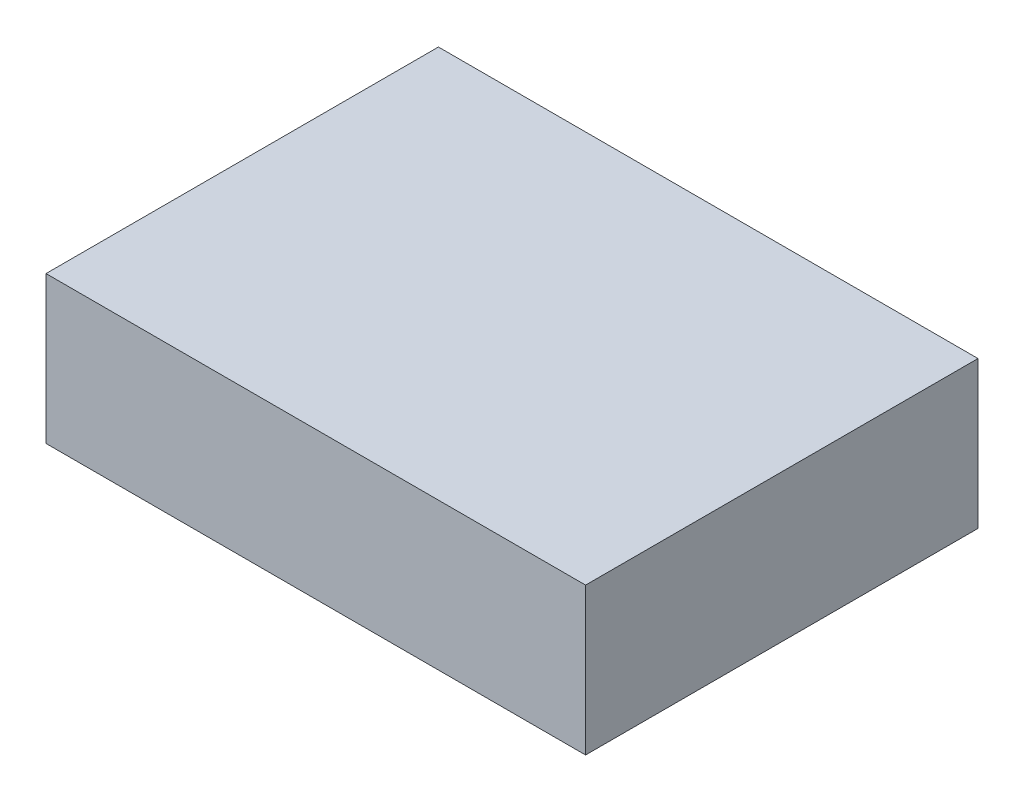
ISO-10303-21;
HEADER;
FILE_DESCRIPTION(('STEP AP214'),'2;1');
FILE_NAME('part.step','',(''),(''),'','','');
FILE_SCHEMA(('AUTOMOTIVE_DESIGN { 1 0 10303 214 1 1 1 1 }'));
ENDSEC;
DATA;
#1=APPLICATION_CONTEXT('core data for automotive mechanical design processes');
#2=APPLICATION_PROTOCOL_DEFINITION('international standard','automotive_design',2000,#1);
#3=PRODUCT_CONTEXT('',#1,'mechanical');
#4=PRODUCT('Part','Part','',(#3));
#5=PRODUCT_RELATED_PRODUCT_CATEGORY('part','',(#4));
#6=PRODUCT_DEFINITION_FORMATION('','',#4);
#7=PRODUCT_DEFINITION_CONTEXT('part definition',#1,'design');
#8=PRODUCT_DEFINITION('design','',#6,#7);
#9=PRODUCT_DEFINITION_SHAPE('','',#8);
#10=(LENGTH_UNIT() NAMED_UNIT(*) SI_UNIT(.MILLI.,.METRE.));
#11=(NAMED_UNIT(*) PLANE_ANGLE_UNIT() SI_UNIT($,.RADIAN.));
#12=(NAMED_UNIT(*) SI_UNIT($,.STERADIAN.) SOLID_ANGLE_UNIT());
#13=UNCERTAINTY_MEASURE_WITH_UNIT(LENGTH_MEASURE(1.E-05),#10,'distance_accuracy_value','');
#14=(GEOMETRIC_REPRESENTATION_CONTEXT(3) GLOBAL_UNCERTAINTY_ASSIGNED_CONTEXT((#13)) GLOBAL_UNIT_ASSIGNED_CONTEXT((#10,
#11,#12)) REPRESENTATION_CONTEXT('',''));
#15=CARTESIAN_POINT('',(0.,0.,0.));
#16=DIRECTION('',(0.,0.,1.));
#17=DIRECTION('',(1.,0.,0.));
#18=AXIS2_PLACEMENT_3D('',#15,#16,#17);
#19=CARTESIAN_POINT('',(-27.5,15.,-20.));
#20=DIRECTION('',(1.,0.,0.));
#21=DIRECTION('',(0.,0.,-1.));
#22=AXIS2_PLACEMENT_3D('',#19,#20,#21);
#23=PLANE('',#22);
#24=DIRECTION('',(0.,0.,1.));
#25=VECTOR('',#24,1.);
#26=CARTESIAN_POINT('',(-27.5,0.,-20.));
#27=LINE('',#26,#25);
#28=CARTESIAN_POINT('',(-27.5,0.,-20.));
#29=VERTEX_POINT('',#28);
#30=CARTESIAN_POINT('',(-27.5,0.,20.));
#31=VERTEX_POINT('',#30);
#32=EDGE_CURVE('E109',#29,#31,#27,.T.);
#33=ORIENTED_EDGE('',*,*,#32,.T.);
#34=DIRECTION('',(0.,-1.,0.));
#35=VECTOR('',#34,1.);
#36=CARTESIAN_POINT('',(-27.5,15.,20.));
#37=LINE('',#36,#35);
#38=CARTESIAN_POINT('',(-27.5,15.,20.));
#39=VERTEX_POINT('',#38);
#40=EDGE_CURVE('E11',#39,#31,#37,.T.);
#41=ORIENTED_EDGE('',*,*,#40,.F.);
#42=DIRECTION('',(0.,0.,1.));
#43=VECTOR('',#42,1.);
#44=CARTESIAN_POINT('',(-27.5,15.,-20.));
#45=LINE('',#44,#43);
#46=CARTESIAN_POINT('',(-27.5,15.,-20.));
#47=VERTEX_POINT('',#46);
#48=EDGE_CURVE('E110',#47,#39,#45,.T.);
#49=ORIENTED_EDGE('',*,*,#48,.F.);
#50=DIRECTION('',(0.,-1.,0.));
#51=VECTOR('',#50,1.);
#52=CARTESIAN_POINT('',(-27.5,15.,-20.));
#53=LINE('',#52,#51);
#54=EDGE_CURVE('E116',#47,#29,#53,.T.);
#55=ORIENTED_EDGE('',*,*,#54,.T.);
#56=EDGE_LOOP('',(#33,#41,#49,#55));
#57=FACE_BOUND('',#56,.T.);
#58=ADVANCED_FACE('F34',(#57),#23,.F.);
#59=CARTESIAN_POINT('',(27.5,15.,20.));
#60=DIRECTION('',(0.,0.,-1.));
#61=DIRECTION('',(-1.,0.,0.));
#62=AXIS2_PLACEMENT_3D('',#59,#60,#61);
#63=PLANE('',#62);
#64=DIRECTION('',(1.,0.,0.));
#65=VECTOR('',#64,1.);
#66=CARTESIAN_POINT('',(27.5,0.,20.));
#67=LINE('',#66,#65);
#68=CARTESIAN_POINT('',(27.5,0.,20.));
#69=VERTEX_POINT('',#68);
#70=EDGE_CURVE('E119',#31,#69,#67,.T.);
#71=ORIENTED_EDGE('',*,*,#70,.T.);
#72=DIRECTION('',(0.,-1.,0.));
#73=VECTOR('',#72,1.);
#74=CARTESIAN_POINT('',(27.5,15.,20.));
#75=LINE('',#74,#73);
#76=CARTESIAN_POINT('',(27.5,15.,20.));
#77=VERTEX_POINT('',#76);
#78=EDGE_CURVE('E42',#77,#69,#75,.T.);
#79=ORIENTED_EDGE('',*,*,#78,.F.);
#80=DIRECTION('',(1.,0.,0.));
#81=VECTOR('',#80,1.);
#82=CARTESIAN_POINT('',(27.5,15.,20.));
#83=LINE('',#82,#81);
#84=EDGE_CURVE('E81',#39,#77,#83,.T.);
#85=ORIENTED_EDGE('',*,*,#84,.F.);
#86=ORIENTED_EDGE('',*,*,#40,.T.);
#87=EDGE_LOOP('',(#71,#79,#85,#86));
#88=FACE_BOUND('',#87,.T.);
#89=ADVANCED_FACE('F142',(#88),#63,.F.);
#90=CARTESIAN_POINT('',(27.5,15.,-20.));
#91=DIRECTION('',(-1.,0.,0.));
#92=DIRECTION('',(0.,0.,1.));
#93=AXIS2_PLACEMENT_3D('',#90,#91,#92);
#94=PLANE('',#93);
#95=DIRECTION('',(0.,0.,-1.));
#96=VECTOR('',#95,1.);
#97=CARTESIAN_POINT('',(27.5,0.,-20.));
#98=LINE('',#97,#96);
#99=CARTESIAN_POINT('',(27.5,0.,-20.));
#100=VERTEX_POINT('',#99);
#101=EDGE_CURVE('E68',#69,#100,#98,.T.);
#102=ORIENTED_EDGE('',*,*,#101,.T.);
#103=DIRECTION('',(0.,-1.,0.));
#104=VECTOR('',#103,1.);
#105=CARTESIAN_POINT('',(27.5,15.,-20.));
#106=LINE('',#105,#104);
#107=CARTESIAN_POINT('',(27.5,15.,-20.));
#108=VERTEX_POINT('',#107);
#109=EDGE_CURVE('E124',#108,#100,#106,.T.);
#110=ORIENTED_EDGE('',*,*,#109,.F.);
#111=DIRECTION('',(0.,0.,-1.));
#112=VECTOR('',#111,1.);
#113=CARTESIAN_POINT('',(27.5,15.,-20.));
#114=LINE('',#113,#112);
#115=EDGE_CURVE('E113',#77,#108,#114,.T.);
#116=ORIENTED_EDGE('',*,*,#115,.F.);
#117=ORIENTED_EDGE('',*,*,#78,.T.);
#118=EDGE_LOOP('',(#102,#110,#116,#117));
#119=FACE_BOUND('',#118,.T.);
#120=ADVANCED_FACE('F126',(#119),#94,.F.);
#121=CARTESIAN_POINT('',(27.5,15.,-20.));
#122=DIRECTION('',(0.,0.,1.));
#123=DIRECTION('',(1.,0.,0.));
#124=AXIS2_PLACEMENT_3D('',#121,#122,#123);
#125=PLANE('',#124);
#126=DIRECTION('',(-1.,0.,0.));
#127=VECTOR('',#126,1.);
#128=CARTESIAN_POINT('',(27.5,0.,-20.));
#129=LINE('',#128,#127);
#130=EDGE_CURVE('E74',#100,#29,#129,.T.);
#131=ORIENTED_EDGE('',*,*,#130,.T.);
#132=ORIENTED_EDGE('',*,*,#54,.F.);
#133=DIRECTION('',(-1.,0.,0.));
#134=VECTOR('',#133,1.);
#135=CARTESIAN_POINT('',(27.5,15.,-20.));
#136=LINE('',#135,#134);
#137=EDGE_CURVE('E50',#108,#47,#136,.T.);
#138=ORIENTED_EDGE('',*,*,#137,.F.);
#139=ORIENTED_EDGE('',*,*,#109,.T.);
#140=EDGE_LOOP('',(#131,#132,#138,#139));
#141=FACE_BOUND('',#140,.T.);
#142=ADVANCED_FACE('F133',(#141),#125,.F.);
#143=CARTESIAN_POINT('',(0.,15.,0.));
#144=DIRECTION('',(0.,-1.,0.));
#145=DIRECTION('',(0.,0.,-1.));
#146=AXIS2_PLACEMENT_3D('',#143,#144,#145);
#147=PLANE('',#146);
#148=ORIENTED_EDGE('',*,*,#48,.T.);
#149=ORIENTED_EDGE('',*,*,#84,.T.);
#150=ORIENTED_EDGE('',*,*,#115,.T.);
#151=ORIENTED_EDGE('',*,*,#137,.T.);
#152=EDGE_LOOP('',(#148,#149,#150,#151));
#153=FACE_BOUND('',#152,.T.);
#154=ADVANCED_FACE('F135',(#153),#147,.F.);
#155=CARTESIAN_POINT('',(0.,0.,0.));
#156=DIRECTION('',(0.,-1.,0.));
#157=DIRECTION('',(0.,0.,-1.));
#158=AXIS2_PLACEMENT_3D('',#155,#156,#157);
#159=PLANE('',#158);
#160=CARTESIAN_POINT('',(23.5,0.,16.));
#161=DIRECTION('',(0.,-1.,0.));
#162=DIRECTION('',(0.,0.,-1.));
#163=AXIS2_PLACEMENT_3D('',#160,#161,#162);
#164=CIRCLE('',#163,0.475);
#165=CARTESIAN_POINT('',(23.5,0.,15.525));
#166=VERTEX_POINT('',#165);
#167=EDGE_CURVE('E99',#166,#166,#164,.T.);
#168=ORIENTED_EDGE('',*,*,#167,.F.);
#169=EDGE_LOOP('',(#168));
#170=FACE_BOUND('',#169,.T.);
#171=CARTESIAN_POINT('',(-23.5,0.,-16.));
#172=DIRECTION('',(0.,-1.,0.));
#173=DIRECTION('',(0.,0.,-1.));
#174=AXIS2_PLACEMENT_3D('',#171,#172,#173);
#175=CIRCLE('',#174,0.475);
#176=CARTESIAN_POINT('',(-23.5,0.,-16.475));
#177=VERTEX_POINT('',#176);
#178=EDGE_CURVE('E98',#177,#177,#175,.T.);
#179=ORIENTED_EDGE('',*,*,#178,.F.);
#180=EDGE_LOOP('',(#179));
#181=FACE_BOUND('',#180,.T.);
#182=ORIENTED_EDGE('',*,*,#32,.F.);
#183=ORIENTED_EDGE('',*,*,#130,.F.);
#184=ORIENTED_EDGE('',*,*,#101,.F.);
#185=ORIENTED_EDGE('',*,*,#70,.F.);
#186=EDGE_LOOP('',(#182,#183,#184,#185));
#187=FACE_BOUND('',#186,.T.);
#188=ADVANCED_FACE('F129',(#170,#181,#187),#159,.T.);
#189=CARTESIAN_POINT('',(-23.5,8.5,-16.));
#190=DIRECTION('',(0.,-1.,0.));
#191=DIRECTION('',(0.,0.,-1.));
#192=AXIS2_PLACEMENT_3D('',#189,#190,#191);
#193=CONICAL_SURFACE('',#192,0.474999999999996,1.02974425867665);
#194=CARTESIAN_POINT('',(-23.5,8.78540879403809,-16.));
#195=VERTEX_POINT('',#194);
#196=VERTEX_LOOP('',#195);
#197=FACE_BOUND('',#196,.T.);
#198=CARTESIAN_POINT('',(-23.5,8.5,-16.));
#199=DIRECTION('',(0.,-1.,0.));
#200=DIRECTION('',(0.,0.,-1.));
#201=AXIS2_PLACEMENT_3D('',#198,#199,#200);
#202=CIRCLE('',#201,0.474999999999996);
#203=CARTESIAN_POINT('',(-23.5,8.5,-16.475));
#204=VERTEX_POINT('',#203);
#205=EDGE_CURVE('E102',#204,#204,#202,.T.);
#206=ORIENTED_EDGE('',*,*,#205,.T.);
#207=EDGE_LOOP('',(#206));
#208=FACE_BOUND('',#207,.T.);
#209=ADVANCED_FACE('F174',(#197,#208),#193,.F.);
#210=CARTESIAN_POINT('',(-23.5,0.,-16.));
#211=DIRECTION('',(0.,-1.,0.));
#212=DIRECTION('',(0.,0.,-1.));
#213=AXIS2_PLACEMENT_3D('',#210,#211,#212);
#214=CYLINDRICAL_SURFACE('',#213,0.474999999999998);
#215=ORIENTED_EDGE('',*,*,#205,.F.);
#216=EDGE_LOOP('',(#215));
#217=FACE_BOUND('',#216,.T.);
#218=ORIENTED_EDGE('',*,*,#178,.T.);
#219=EDGE_LOOP('',(#218));
#220=FACE_BOUND('',#219,.T.);
#221=ADVANCED_FACE('F92',(#217,#220),#214,.F.);
#222=CARTESIAN_POINT('',(23.5,8.5,16.));
#223=DIRECTION('',(0.,-1.,0.));
#224=DIRECTION('',(0.,0.,-1.));
#225=AXIS2_PLACEMENT_3D('',#222,#223,#224);
#226=CONICAL_SURFACE('',#225,0.474999999999996,1.02974425867665);
#227=CARTESIAN_POINT('',(23.5,8.78540879403809,16.));
#228=VERTEX_POINT('',#227);
#229=VERTEX_LOOP('',#228);
#230=FACE_BOUND('',#229,.T.);
#231=CARTESIAN_POINT('',(23.5,8.5,16.));
#232=DIRECTION('',(0.,-1.,0.));
#233=DIRECTION('',(0.,0.,-1.));
#234=AXIS2_PLACEMENT_3D('',#231,#232,#233);
#235=CIRCLE('',#234,0.474999999999996);
#236=CARTESIAN_POINT('',(23.5,8.5,15.525));
#237=VERTEX_POINT('',#236);
#238=EDGE_CURVE('E96',#237,#237,#235,.T.);
#239=ORIENTED_EDGE('',*,*,#238,.T.);
#240=EDGE_LOOP('',(#239));
#241=FACE_BOUND('',#240,.T.);
#242=ADVANCED_FACE('F88',(#230,#241),#226,.F.);
#243=CARTESIAN_POINT('',(23.5,0.,16.));
#244=DIRECTION('',(0.,-1.,0.));
#245=DIRECTION('',(0.,0.,-1.));
#246=AXIS2_PLACEMENT_3D('',#243,#244,#245);
#247=CYLINDRICAL_SURFACE('',#246,0.474999999999998);
#248=ORIENTED_EDGE('',*,*,#238,.F.);
#249=EDGE_LOOP('',(#248));
#250=FACE_BOUND('',#249,.T.);
#251=ORIENTED_EDGE('',*,*,#167,.T.);
#252=EDGE_LOOP('',(#251));
#253=FACE_BOUND('',#252,.T.);
#254=ADVANCED_FACE('F91',(#250,#253),#247,.F.);
#255=CLOSED_SHELL('',(#58,#89,#120,#142,#154,#188,#209,#221,#242,#254));
#256=MANIFOLD_SOLID_BREP('B2',#255);
#257=ADVANCED_BREP_SHAPE_REPRESENTATION('',(#18,#256),#14);
#258=SHAPE_DEFINITION_REPRESENTATION(#9,#257);
ENDSEC;
END-ISO-10303-21;
